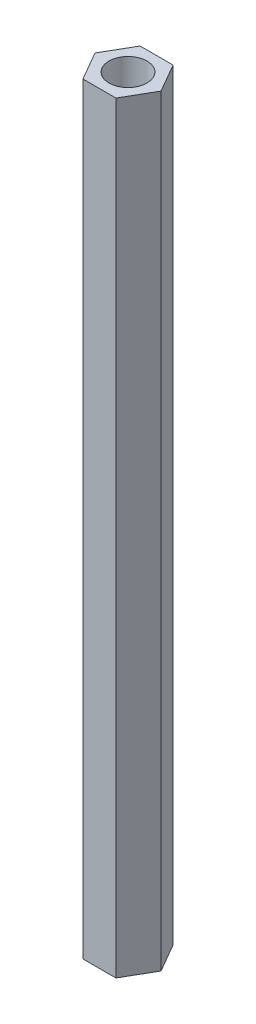
ISO-10303-21;
HEADER;
FILE_DESCRIPTION(('STEP AP214'),'2;1');
FILE_NAME('part.step','',(''),(''),'','','');
FILE_SCHEMA(('AUTOMOTIVE_DESIGN { 1 0 10303 214 1 1 1 1 }'));
ENDSEC;
DATA;
#1=APPLICATION_CONTEXT('core data for automotive mechanical design processes');
#2=APPLICATION_PROTOCOL_DEFINITION('international standard','automotive_design',2000,#1);
#3=PRODUCT_CONTEXT('',#1,'mechanical');
#4=PRODUCT('Part','Part','',(#3));
#5=PRODUCT_RELATED_PRODUCT_CATEGORY('part','',(#4));
#6=PRODUCT_DEFINITION_FORMATION('','',#4);
#7=PRODUCT_DEFINITION_CONTEXT('part definition',#1,'design');
#8=PRODUCT_DEFINITION('design','',#6,#7);
#9=PRODUCT_DEFINITION_SHAPE('','',#8);
#10=(LENGTH_UNIT() NAMED_UNIT(*) SI_UNIT(.MILLI.,.METRE.));
#11=(NAMED_UNIT(*) PLANE_ANGLE_UNIT() SI_UNIT($,.RADIAN.));
#12=(NAMED_UNIT(*) SI_UNIT($,.STERADIAN.) SOLID_ANGLE_UNIT());
#13=UNCERTAINTY_MEASURE_WITH_UNIT(LENGTH_MEASURE(1.E-05),#10,'distance_accuracy_value','');
#14=(GEOMETRIC_REPRESENTATION_CONTEXT(3) GLOBAL_UNCERTAINTY_ASSIGNED_CONTEXT((#13)) GLOBAL_UNIT_ASSIGNED_CONTEXT((#10,
#11,#12)) REPRESENTATION_CONTEXT('',''));
#15=CARTESIAN_POINT('',(0.,0.,0.));
#16=DIRECTION('',(0.,0.,1.));
#17=DIRECTION('',(1.,0.,0.));
#18=AXIS2_PLACEMENT_3D('',#15,#16,#17);
#19=CARTESIAN_POINT('',(0.,80.,0.));
#20=DIRECTION('',(0.,1.,0.));
#21=DIRECTION('',(0.,0.,1.));
#22=AXIS2_PLACEMENT_3D('',#19,#20,#21);
#23=PLANE('',#22);
#24=DIRECTION('',(-0.5,0.,-0.866025403784438));
#25=VECTOR('',#24,1.);
#26=CARTESIAN_POINT('',(3.46410161513775,80.,0.));
#27=LINE('',#26,#25);
#28=CARTESIAN_POINT('',(3.46410161513775,80.,0.));
#29=VERTEX_POINT('',#28);
#30=CARTESIAN_POINT('',(1.73205080756888,80.,-3.));
#31=VERTEX_POINT('',#30);
#32=EDGE_CURVE('E135',#29,#31,#27,.T.);
#33=ORIENTED_EDGE('',*,*,#32,.T.);
#34=DIRECTION('',(-1.,0.,0.));
#35=VECTOR('',#34,1.);
#36=CARTESIAN_POINT('',(1.73205080756888,80.,-3.));
#37=LINE('',#36,#35);
#38=CARTESIAN_POINT('',(-1.73205080756888,80.,-3.));
#39=VERTEX_POINT('',#38);
#40=EDGE_CURVE('E93',#31,#39,#37,.T.);
#41=ORIENTED_EDGE('',*,*,#40,.T.);
#42=DIRECTION('',(-0.499999999999999,0.,0.866025403784439));
#43=VECTOR('',#42,1.);
#44=CARTESIAN_POINT('',(-1.73205080756888,80.,-3.));
#45=LINE('',#44,#43);
#46=CARTESIAN_POINT('',(-3.46410161513775,80.,0.));
#47=VERTEX_POINT('',#46);
#48=EDGE_CURVE('E106',#39,#47,#45,.T.);
#49=ORIENTED_EDGE('',*,*,#48,.T.);
#50=DIRECTION('',(0.5,0.,0.866025403784438));
#51=VECTOR('',#50,1.);
#52=CARTESIAN_POINT('',(-3.46410161513775,80.,0.));
#53=LINE('',#52,#51);
#54=CARTESIAN_POINT('',(-1.73205080756888,80.,3.));
#55=VERTEX_POINT('',#54);
#56=EDGE_CURVE('E100',#47,#55,#53,.T.);
#57=ORIENTED_EDGE('',*,*,#56,.T.);
#58=DIRECTION('',(1.,0.,0.));
#59=VECTOR('',#58,1.);
#60=CARTESIAN_POINT('',(-1.73205080756888,80.,3.));
#61=LINE('',#60,#59);
#62=CARTESIAN_POINT('',(1.73205080756888,80.,3.));
#63=VERTEX_POINT('',#62);
#64=EDGE_CURVE('E104',#55,#63,#61,.T.);
#65=ORIENTED_EDGE('',*,*,#64,.T.);
#66=DIRECTION('',(0.5,0.,-0.866025403784439));
#67=VECTOR('',#66,1.);
#68=CARTESIAN_POINT('',(1.73205080756888,80.,3.));
#69=LINE('',#68,#67);
#70=EDGE_CURVE('E56',#63,#29,#69,.T.);
#71=ORIENTED_EDGE('',*,*,#70,.T.);
#72=EDGE_LOOP('',(#33,#41,#49,#57,#65,#71));
#73=FACE_BOUND('',#72,.T.);
#74=CARTESIAN_POINT('',(0.,80.,0.));
#75=DIRECTION('',(0.,1.,0.));
#76=DIRECTION('',(0.,0.,1.));
#77=AXIS2_PLACEMENT_3D('',#74,#75,#76);
#78=CIRCLE('',#77,2.);
#79=CARTESIAN_POINT('',(0.,80.,2.));
#80=VERTEX_POINT('',#79);
#81=EDGE_CURVE('E128',#80,#80,#78,.T.);
#82=ORIENTED_EDGE('',*,*,#81,.F.);
#83=EDGE_LOOP('',(#82));
#84=FACE_BOUND('',#83,.T.);
#85=ADVANCED_FACE('F39',(#73,#84),#23,.T.);
#86=CARTESIAN_POINT('',(0.,0.,0.));
#87=DIRECTION('',(0.,1.,0.));
#88=DIRECTION('',(0.,0.,1.));
#89=AXIS2_PLACEMENT_3D('',#86,#87,#88);
#90=PLANE('',#89);
#91=DIRECTION('',(-0.5,0.,-0.866025403784438));
#92=VECTOR('',#91,1.);
#93=CARTESIAN_POINT('',(3.46410161513775,0.,0.));
#94=LINE('',#93,#92);
#95=CARTESIAN_POINT('',(3.46410161513775,0.,0.));
#96=VERTEX_POINT('',#95);
#97=CARTESIAN_POINT('',(1.73205080756888,0.,-3.));
#98=VERTEX_POINT('',#97);
#99=EDGE_CURVE('E124',#96,#98,#94,.T.);
#100=ORIENTED_EDGE('',*,*,#99,.F.);
#101=DIRECTION('',(0.5,0.,-0.866025403784439));
#102=VECTOR('',#101,1.);
#103=CARTESIAN_POINT('',(1.73205080756888,0.,3.));
#104=LINE('',#103,#102);
#105=CARTESIAN_POINT('',(1.73205080756888,0.,3.));
#106=VERTEX_POINT('',#105);
#107=EDGE_CURVE('E85',#106,#96,#104,.T.);
#108=ORIENTED_EDGE('',*,*,#107,.F.);
#109=DIRECTION('',(1.,0.,0.));
#110=VECTOR('',#109,1.);
#111=CARTESIAN_POINT('',(-1.73205080756888,0.,3.));
#112=LINE('',#111,#110);
#113=CARTESIAN_POINT('',(-1.73205080756888,0.,3.));
#114=VERTEX_POINT('',#113);
#115=EDGE_CURVE('E79',#114,#106,#112,.T.);
#116=ORIENTED_EDGE('',*,*,#115,.F.);
#117=DIRECTION('',(0.5,0.,0.866025403784438));
#118=VECTOR('',#117,1.);
#119=CARTESIAN_POINT('',(-3.46410161513775,0.,0.));
#120=LINE('',#119,#118);
#121=CARTESIAN_POINT('',(-3.46410161513775,0.,0.));
#122=VERTEX_POINT('',#121);
#123=EDGE_CURVE('E114',#122,#114,#120,.T.);
#124=ORIENTED_EDGE('',*,*,#123,.F.);
#125=DIRECTION('',(-0.499999999999999,0.,0.866025403784439));
#126=VECTOR('',#125,1.);
#127=CARTESIAN_POINT('',(-1.73205080756888,0.,-3.));
#128=LINE('',#127,#126);
#129=CARTESIAN_POINT('',(-1.73205080756888,0.,-3.));
#130=VERTEX_POINT('',#129);
#131=EDGE_CURVE('E130',#130,#122,#128,.T.);
#132=ORIENTED_EDGE('',*,*,#131,.F.);
#133=DIRECTION('',(-1.,0.,0.));
#134=VECTOR('',#133,1.);
#135=CARTESIAN_POINT('',(1.73205080756888,0.,-3.));
#136=LINE('',#135,#134);
#137=EDGE_CURVE('E127',#98,#130,#136,.T.);
#138=ORIENTED_EDGE('',*,*,#137,.F.);
#139=EDGE_LOOP('',(#100,#108,#116,#124,#132,#138));
#140=FACE_BOUND('',#139,.T.);
#141=CARTESIAN_POINT('',(0.,0.,0.));
#142=DIRECTION('',(0.,1.,0.));
#143=DIRECTION('',(0.,0.,1.));
#144=AXIS2_PLACEMENT_3D('',#141,#142,#143);
#145=CIRCLE('',#144,2.);
#146=CARTESIAN_POINT('',(0.,0.,2.));
#147=VERTEX_POINT('',#146);
#148=EDGE_CURVE('E228',#147,#147,#145,.T.);
#149=ORIENTED_EDGE('',*,*,#148,.T.);
#150=EDGE_LOOP('',(#149));
#151=FACE_BOUND('',#150,.T.);
#152=ADVANCED_FACE('F144',(#140,#151),#90,.F.);
#153=CARTESIAN_POINT('',(3.46410161513775,80.,0.));
#154=DIRECTION('',(-0.866025403784438,0.,0.5));
#155=DIRECTION('',(0.5,0.,0.866025403784438));
#156=AXIS2_PLACEMENT_3D('',#153,#154,#155);
#157=PLANE('',#156);
#158=ORIENTED_EDGE('',*,*,#99,.T.);
#159=DIRECTION('',(0.,-1.,0.));
#160=VECTOR('',#159,1.);
#161=CARTESIAN_POINT('',(1.73205080756888,80.,-3.));
#162=LINE('',#161,#160);
#163=EDGE_CURVE('E11',#31,#98,#162,.T.);
#164=ORIENTED_EDGE('',*,*,#163,.F.);
#165=ORIENTED_EDGE('',*,*,#32,.F.);
#166=DIRECTION('',(0.,-1.,0.));
#167=VECTOR('',#166,1.);
#168=CARTESIAN_POINT('',(3.46410161513775,80.,0.));
#169=LINE('',#168,#167);
#170=EDGE_CURVE('E120',#29,#96,#169,.T.);
#171=ORIENTED_EDGE('',*,*,#170,.T.);
#172=EDGE_LOOP('',(#158,#164,#165,#171));
#173=FACE_BOUND('',#172,.T.);
#174=ADVANCED_FACE('F41',(#173),#157,.F.);
#175=CARTESIAN_POINT('',(1.73205080756888,80.,-3.));
#176=DIRECTION('',(0.,0.,1.));
#177=DIRECTION('',(1.,0.,0.));
#178=AXIS2_PLACEMENT_3D('',#175,#176,#177);
#179=PLANE('',#178);
#180=ORIENTED_EDGE('',*,*,#137,.T.);
#181=DIRECTION('',(0.,-1.,0.));
#182=VECTOR('',#181,1.);
#183=CARTESIAN_POINT('',(-1.73205080756888,80.,-3.));
#184=LINE('',#183,#182);
#185=EDGE_CURVE('E48',#39,#130,#184,.T.);
#186=ORIENTED_EDGE('',*,*,#185,.F.);
#187=ORIENTED_EDGE('',*,*,#40,.F.);
#188=ORIENTED_EDGE('',*,*,#163,.T.);
#189=EDGE_LOOP('',(#180,#186,#187,#188));
#190=FACE_BOUND('',#189,.T.);
#191=ADVANCED_FACE('F169',(#190),#179,.F.);
#192=CARTESIAN_POINT('',(-1.73205080756888,80.,-3.));
#193=DIRECTION('',(0.866025403784439,0.,0.5));
#194=DIRECTION('',(0.5,0.,-0.866025403784439));
#195=AXIS2_PLACEMENT_3D('',#192,#193,#194);
#196=PLANE('',#195);
#197=ORIENTED_EDGE('',*,*,#131,.T.);
#198=DIRECTION('',(0.,-1.,0.));
#199=VECTOR('',#198,1.);
#200=CARTESIAN_POINT('',(-3.46410161513775,80.,0.));
#201=LINE('',#200,#199);
#202=EDGE_CURVE('E115',#47,#122,#201,.T.);
#203=ORIENTED_EDGE('',*,*,#202,.F.);
#204=ORIENTED_EDGE('',*,*,#48,.F.);
#205=ORIENTED_EDGE('',*,*,#185,.T.);
#206=EDGE_LOOP('',(#197,#203,#204,#205));
#207=FACE_BOUND('',#206,.T.);
#208=ADVANCED_FACE('F141',(#207),#196,.F.);
#209=CARTESIAN_POINT('',(-3.46410161513775,80.,0.));
#210=DIRECTION('',(0.866025403784438,0.,-0.5));
#211=DIRECTION('',(-0.5,0.,-0.866025403784439));
#212=AXIS2_PLACEMENT_3D('',#209,#210,#211);
#213=PLANE('',#212);
#214=ORIENTED_EDGE('',*,*,#123,.T.);
#215=DIRECTION('',(0.,-1.,0.));
#216=VECTOR('',#215,1.);
#217=CARTESIAN_POINT('',(-1.73205080756888,80.,3.));
#218=LINE('',#217,#216);
#219=EDGE_CURVE('E111',#55,#114,#218,.T.);
#220=ORIENTED_EDGE('',*,*,#219,.F.);
#221=ORIENTED_EDGE('',*,*,#56,.F.);
#222=ORIENTED_EDGE('',*,*,#202,.T.);
#223=EDGE_LOOP('',(#214,#220,#221,#222));
#224=FACE_BOUND('',#223,.T.);
#225=ADVANCED_FACE('F112',(#224),#213,.F.);
#226=CARTESIAN_POINT('',(-1.73205080756888,80.,3.));
#227=DIRECTION('',(0.,0.,-1.));
#228=DIRECTION('',(-1.,0.,0.));
#229=AXIS2_PLACEMENT_3D('',#226,#227,#228);
#230=PLANE('',#229);
#231=ORIENTED_EDGE('',*,*,#115,.T.);
#232=DIRECTION('',(0.,-1.,0.));
#233=VECTOR('',#232,1.);
#234=CARTESIAN_POINT('',(1.73205080756888,80.,3.));
#235=LINE('',#234,#233);
#236=EDGE_CURVE('E116',#63,#106,#235,.T.);
#237=ORIENTED_EDGE('',*,*,#236,.F.);
#238=ORIENTED_EDGE('',*,*,#64,.F.);
#239=ORIENTED_EDGE('',*,*,#219,.T.);
#240=EDGE_LOOP('',(#231,#237,#238,#239));
#241=FACE_BOUND('',#240,.T.);
#242=ADVANCED_FACE('F118',(#241),#230,.F.);
#243=CARTESIAN_POINT('',(1.73205080756888,80.,3.));
#244=DIRECTION('',(-0.866025403784439,0.,-0.5));
#245=DIRECTION('',(-0.5,0.,0.866025403784439));
#246=AXIS2_PLACEMENT_3D('',#243,#244,#245);
#247=PLANE('',#246);
#248=ORIENTED_EDGE('',*,*,#107,.T.);
#249=ORIENTED_EDGE('',*,*,#170,.F.);
#250=ORIENTED_EDGE('',*,*,#70,.F.);
#251=ORIENTED_EDGE('',*,*,#236,.T.);
#252=EDGE_LOOP('',(#248,#249,#250,#251));
#253=FACE_BOUND('',#252,.T.);
#254=ADVANCED_FACE('F149',(#253),#247,.F.);
#255=CARTESIAN_POINT('',(0.,80.,0.));
#256=DIRECTION('',(0.,-1.,0.));
#257=DIRECTION('',(0.,0.,-1.));
#258=AXIS2_PLACEMENT_3D('',#255,#256,#257);
#259=CYLINDRICAL_SURFACE('',#258,2.);
#260=ORIENTED_EDGE('',*,*,#81,.T.);
#261=EDGE_LOOP('',(#260));
#262=FACE_BOUND('',#261,.T.);
#263=ORIENTED_EDGE('',*,*,#148,.F.);
#264=EDGE_LOOP('',(#263));
#265=FACE_BOUND('',#264,.T.);
#266=ADVANCED_FACE('F151',(#262,#265),#259,.F.);
#267=CLOSED_SHELL('',(#85,#152,#174,#191,#208,#225,#242,#254,#266));
#268=MANIFOLD_SOLID_BREP('B2',#267);
#269=ADVANCED_BREP_SHAPE_REPRESENTATION('',(#18,#268),#14);
#270=SHAPE_DEFINITION_REPRESENTATION(#9,#269);
ENDSEC;
END-ISO-10303-21;
